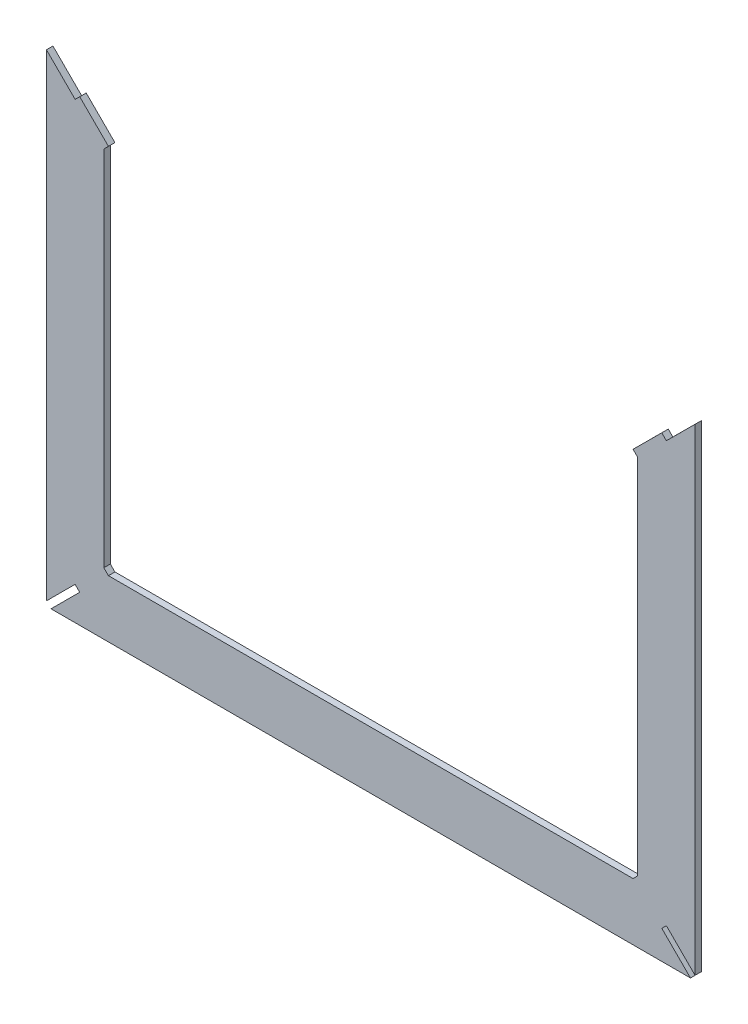
ISO-10303-21;
HEADER;
FILE_DESCRIPTION(('STEP AP214'),'2;1');
FILE_NAME('part.step','',(''),(''),'','','');
FILE_SCHEMA(('AUTOMOTIVE_DESIGN { 1 0 10303 214 1 1 1 1 }'));
ENDSEC;
DATA;
#1=APPLICATION_CONTEXT('core data for automotive mechanical design processes');
#2=APPLICATION_PROTOCOL_DEFINITION('international standard','automotive_design',2000,#1);
#3=PRODUCT_CONTEXT('',#1,'mechanical');
#4=PRODUCT('Part','Part','',(#3));
#5=PRODUCT_RELATED_PRODUCT_CATEGORY('part','',(#4));
#6=PRODUCT_DEFINITION_FORMATION('','',#4);
#7=PRODUCT_DEFINITION_CONTEXT('part definition',#1,'design');
#8=PRODUCT_DEFINITION('design','',#6,#7);
#9=PRODUCT_DEFINITION_SHAPE('','',#8);
#10=(LENGTH_UNIT() NAMED_UNIT(*) SI_UNIT(.MILLI.,.METRE.));
#11=(NAMED_UNIT(*) PLANE_ANGLE_UNIT() SI_UNIT($,.RADIAN.));
#12=(NAMED_UNIT(*) SI_UNIT($,.STERADIAN.) SOLID_ANGLE_UNIT());
#13=UNCERTAINTY_MEASURE_WITH_UNIT(LENGTH_MEASURE(1.E-05),#10,'distance_accuracy_value','');
#14=(GEOMETRIC_REPRESENTATION_CONTEXT(3) GLOBAL_UNCERTAINTY_ASSIGNED_CONTEXT((#13)) GLOBAL_UNIT_ASSIGNED_CONTEXT((#10,
#11,#12)) REPRESENTATION_CONTEXT('',''));
#15=CARTESIAN_POINT('',(0.,0.,0.));
#16=DIRECTION('',(0.,0.,1.));
#17=DIRECTION('',(1.,0.,0.));
#18=AXIS2_PLACEMENT_3D('',#15,#16,#17);
#19=CARTESIAN_POINT('',(-395.931011651863,-137.132902491065,4.));
#20=DIRECTION('',(0.,-1.,0.));
#21=DIRECTION('',(1.,0.,0.));
#22=AXIS2_PLACEMENT_3D('',#19,#20,#21);
#23=PLANE('',#22);
#24=DIRECTION('',(-1.,0.,0.));
#25=VECTOR('',#24,1.);
#26=CARTESIAN_POINT('',(-395.931011651863,-137.132902491065,0.));
#27=LINE('',#26,#25);
#28=CARTESIAN_POINT('',(-72.3878659013533,-137.132902491067,0.));
#29=VERTEX_POINT('',#28);
#30=CARTESIAN_POINT('',(-395.931011651863,-137.132902491065,0.));
#31=VERTEX_POINT('',#30);
#32=EDGE_CURVE('E213',#29,#31,#27,.T.);
#33=ORIENTED_EDGE('',*,*,#32,.T.);
#34=DIRECTION('',(0.,0.,-1.));
#35=VECTOR('',#34,1.);
#36=CARTESIAN_POINT('',(-395.931011651863,-137.132902491065,4.));
#37=LINE('',#36,#35);
#38=CARTESIAN_POINT('',(-395.931011651863,-137.132902491065,4.));
#39=VERTEX_POINT('',#38);
#40=EDGE_CURVE('E11',#39,#31,#37,.T.);
#41=ORIENTED_EDGE('',*,*,#40,.F.);
#42=DIRECTION('',(-1.,0.,0.));
#43=VECTOR('',#42,1.);
#44=CARTESIAN_POINT('',(-395.931011651863,-137.132902491065,4.));
#45=LINE('',#44,#43);
#46=CARTESIAN_POINT('',(-72.3878659013533,-137.132902491067,4.));
#47=VERTEX_POINT('',#46);
#48=EDGE_CURVE('E255',#47,#39,#45,.T.);
#49=ORIENTED_EDGE('',*,*,#48,.F.);
#50=DIRECTION('',(0.,0.,-1.));
#51=VECTOR('',#50,1.);
#52=CARTESIAN_POINT('',(-72.3878659013533,-137.132902491067,4.));
#53=LINE('',#52,#51);
#54=EDGE_CURVE('E209',#47,#29,#53,.T.);
#55=ORIENTED_EDGE('',*,*,#54,.T.);
#56=EDGE_LOOP('',(#33,#41,#49,#55));
#57=FACE_BOUND('',#56,.T.);
#58=ADVANCED_FACE('F33',(#57),#23,.F.);
#59=CARTESIAN_POINT('',(-398.759438776609,-134.304475366321,4.));
#60=DIRECTION('',(-0.707106781186277,-0.707106781186818,0.));
#61=DIRECTION('',(0.707106781186818,-0.707106781186277,0.));
#62=AXIS2_PLACEMENT_3D('',#59,#60,#61);
#63=PLANE('',#62);
#64=DIRECTION('',(-0.707106781186818,0.707106781186277,0.));
#65=VECTOR('',#64,1.);
#66=CARTESIAN_POINT('',(-398.759438776609,-134.304475366321,0.));
#67=LINE('',#66,#65);
#68=CARTESIAN_POINT('',(-398.759438776609,-134.304475366321,0.));
#69=VERTEX_POINT('',#68);
#70=EDGE_CURVE('E216',#31,#69,#67,.T.);
#71=ORIENTED_EDGE('',*,*,#70,.T.);
#72=DIRECTION('',(0.,0.,-1.));
#73=VECTOR('',#72,1.);
#74=CARTESIAN_POINT('',(-398.759438776609,-134.304475366321,4.));
#75=LINE('',#74,#73);
#76=CARTESIAN_POINT('',(-398.759438776609,-134.304475366321,4.));
#77=VERTEX_POINT('',#76);
#78=EDGE_CURVE('E41',#77,#69,#75,.T.);
#79=ORIENTED_EDGE('',*,*,#78,.F.);
#80=DIRECTION('',(-0.707106781186818,0.707106781186277,0.));
#81=VECTOR('',#80,1.);
#82=CARTESIAN_POINT('',(-398.759438776609,-134.304475366321,4.));
#83=LINE('',#82,#81);
#84=EDGE_CURVE('E134',#39,#77,#83,.T.);
#85=ORIENTED_EDGE('',*,*,#84,.F.);
#86=ORIENTED_EDGE('',*,*,#40,.T.);
#87=EDGE_LOOP('',(#71,#79,#85,#86));
#88=FACE_BOUND('',#87,.T.);
#89=ADVANCED_FACE('F383',(#88),#63,.F.);
#90=CARTESIAN_POINT('',(-398.759438776609,89.3280487527306,4.));
#91=DIRECTION('',(-1.,0.,0.));
#92=DIRECTION('',(0.,0.,1.));
#93=AXIS2_PLACEMENT_3D('',#90,#91,#92);
#94=PLANE('',#93);
#95=DIRECTION('',(0.,1.,0.));
#96=VECTOR('',#95,1.);
#97=CARTESIAN_POINT('',(-398.759438776609,89.3280487527306,0.));
#98=LINE('',#97,#96);
#99=CARTESIAN_POINT('',(-398.759438776609,89.3280487527306,0.));
#100=VERTEX_POINT('',#99);
#101=EDGE_CURVE('E218',#69,#100,#98,.T.);
#102=ORIENTED_EDGE('',*,*,#101,.T.);
#103=DIRECTION('',(0.,0.,-1.));
#104=VECTOR('',#103,1.);
#105=CARTESIAN_POINT('',(-398.759438776609,89.3280487527306,4.));
#106=LINE('',#105,#104);
#107=CARTESIAN_POINT('',(-398.759438776609,89.3280487527306,4.));
#108=VERTEX_POINT('',#107);
#109=EDGE_CURVE('E304',#108,#100,#106,.T.);
#110=ORIENTED_EDGE('',*,*,#109,.F.);
#111=DIRECTION('',(0.,1.,0.));
#112=VECTOR('',#111,1.);
#113=CARTESIAN_POINT('',(-398.759438776609,89.3280487527306,4.));
#114=LINE('',#113,#112);
#115=EDGE_CURVE('E312',#77,#108,#114,.T.);
#116=ORIENTED_EDGE('',*,*,#115,.F.);
#117=ORIENTED_EDGE('',*,*,#78,.T.);
#118=EDGE_LOOP('',(#102,#110,#116,#117));
#119=FACE_BOUND('',#118,.T.);
#120=ADVANCED_FACE('F310',(#119),#94,.F.);
#121=CARTESIAN_POINT('',(-395.934589046093,92.1600487527305,4.));
#122=DIRECTION('',(-0.707999999999985,0.706212432629178,0.));
#123=DIRECTION('',(-0.706212432629178,-0.707999999999985,0.));
#124=AXIS2_PLACEMENT_3D('',#121,#122,#123);
#125=PLANE('',#124);
#126=DIRECTION('',(0.706212432629178,0.707999999999985,0.));
#127=VECTOR('',#126,1.);
#128=CARTESIAN_POINT('',(-395.934589046093,92.1600487527305,0.));
#129=LINE('',#128,#127);
#130=CARTESIAN_POINT('',(-395.934589046093,92.1600487527305,0.));
#131=VERTEX_POINT('',#130);
#132=EDGE_CURVE('E220',#100,#131,#129,.T.);
#133=ORIENTED_EDGE('',*,*,#132,.T.);
#134=DIRECTION('',(0.,0.,-1.));
#135=VECTOR('',#134,1.);
#136=CARTESIAN_POINT('',(-395.934589046093,92.1600487527305,4.));
#137=LINE('',#136,#135);
#138=CARTESIAN_POINT('',(-395.934589046093,92.1600487527305,4.));
#139=VERTEX_POINT('',#138);
#140=EDGE_CURVE('E301',#139,#131,#137,.T.);
#141=ORIENTED_EDGE('',*,*,#140,.F.);
#142=DIRECTION('',(0.706212432629178,0.707999999999985,0.));
#143=VECTOR('',#142,1.);
#144=CARTESIAN_POINT('',(-395.934589046093,92.1600487527305,4.));
#145=LINE('',#144,#143);
#146=EDGE_CURVE('E330',#108,#139,#145,.T.);
#147=ORIENTED_EDGE('',*,*,#146,.F.);
#148=ORIENTED_EDGE('',*,*,#109,.T.);
#149=EDGE_LOOP('',(#133,#141,#147,#148));
#150=FACE_BOUND('',#149,.T.);
#151=ADVANCED_FACE('F321',(#150),#125,.F.);
#152=CARTESIAN_POINT('',(-395.934589046093,92.1600487527305,4.));
#153=DIRECTION('',(-0.706212432629162,-0.708000000000001,0.));
#154=DIRECTION('',(0.708000000000001,-0.706212432629162,0.));
#155=AXIS2_PLACEMENT_3D('',#152,#153,#154);
#156=PLANE('',#155);
#157=DIRECTION('',(-0.708000000000001,0.706212432629162,0.));
#158=VECTOR('',#157,1.);
#159=CARTESIAN_POINT('',(-395.934589046093,92.1600487527305,0.));
#160=LINE('',#159,#158);
#161=CARTESIAN_POINT('',(-413.634589046093,109.81535956846,0.));
#162=VERTEX_POINT('',#161);
#163=EDGE_CURVE('E222',#131,#162,#160,.T.);
#164=ORIENTED_EDGE('',*,*,#163,.T.);
#165=DIRECTION('',(0.,0.,-1.));
#166=VECTOR('',#165,1.);
#167=CARTESIAN_POINT('',(-413.634589046093,109.81535956846,4.));
#168=LINE('',#167,#166);
#169=CARTESIAN_POINT('',(-413.634589046093,109.81535956846,4.));
#170=VERTEX_POINT('',#169);
#171=EDGE_CURVE('E298',#170,#162,#168,.T.);
#172=ORIENTED_EDGE('',*,*,#171,.F.);
#173=DIRECTION('',(-0.708000000000001,0.706212432629162,0.));
#174=VECTOR('',#173,1.);
#175=CARTESIAN_POINT('',(-395.934589046093,92.1600487527305,4.));
#176=LINE('',#175,#174);
#177=EDGE_CURVE('E327',#139,#170,#176,.T.);
#178=ORIENTED_EDGE('',*,*,#177,.F.);
#179=ORIENTED_EDGE('',*,*,#140,.T.);
#180=EDGE_LOOP('',(#164,#172,#178,#179));
#181=FACE_BOUND('',#180,.T.);
#182=ADVANCED_FACE('F325',(#181),#156,.F.);
#183=CARTESIAN_POINT('',(-413.634589046093,109.81535956846,4.));
#184=DIRECTION('',(0.708,-0.706212432629163,0.));
#185=DIRECTION('',(0.706212432629163,0.708,0.));
#186=AXIS2_PLACEMENT_3D('',#183,#184,#185);
#187=PLANE('',#186);
#188=DIRECTION('',(-0.706212432629163,-0.708,0.));
#189=VECTOR('',#188,1.);
#190=CARTESIAN_POINT('',(-413.634589046093,109.81535956846,0.));
#191=LINE('',#190,#189);
#192=CARTESIAN_POINT('',(-416.459438776609,106.98335956846,0.));
#193=VERTEX_POINT('',#192);
#194=EDGE_CURVE('E224',#162,#193,#191,.T.);
#195=ORIENTED_EDGE('',*,*,#194,.T.);
#196=DIRECTION('',(0.,0.,-1.));
#197=VECTOR('',#196,1.);
#198=CARTESIAN_POINT('',(-416.459438776609,106.98335956846,4.));
#199=LINE('',#198,#197);
#200=CARTESIAN_POINT('',(-416.459438776609,106.98335956846,4.));
#201=VERTEX_POINT('',#200);
#202=EDGE_CURVE('E295',#201,#193,#199,.T.);
#203=ORIENTED_EDGE('',*,*,#202,.F.);
#204=DIRECTION('',(-0.706212432629163,-0.708,0.));
#205=VECTOR('',#204,1.);
#206=CARTESIAN_POINT('',(-413.634589046093,109.81535956846,4.));
#207=LINE('',#206,#205);
#208=EDGE_CURVE('E329',#170,#201,#207,.T.);
#209=ORIENTED_EDGE('',*,*,#208,.F.);
#210=ORIENTED_EDGE('',*,*,#171,.T.);
#211=EDGE_LOOP('',(#195,#203,#209,#210));
#212=FACE_BOUND('',#211,.T.);
#213=ADVANCED_FACE('F396',(#212),#187,.F.);
#214=CARTESIAN_POINT('',(-416.459438776609,106.98335956846,4.));
#215=DIRECTION('',(-0.706212432629163,-0.708,0.));
#216=DIRECTION('',(0.708,-0.706212432629163,0.));
#217=AXIS2_PLACEMENT_3D('',#214,#215,#216);
#218=PLANE('',#217);
#219=DIRECTION('',(-0.708,0.706212432629163,0.));
#220=VECTOR('',#219,1.);
#221=CARTESIAN_POINT('',(-416.459438776609,106.98335956846,0.));
#222=LINE('',#221,#220);
#223=CARTESIAN_POINT('',(-434.159438776609,124.638670384189,0.));
#224=VERTEX_POINT('',#223);
#225=EDGE_CURVE('E226',#193,#224,#222,.T.);
#226=ORIENTED_EDGE('',*,*,#225,.T.);
#227=DIRECTION('',(0.,0.,-1.));
#228=VECTOR('',#227,1.);
#229=CARTESIAN_POINT('',(-434.159438776609,124.638670384189,4.));
#230=LINE('',#229,#228);
#231=CARTESIAN_POINT('',(-434.159438776609,124.638670384189,4.));
#232=VERTEX_POINT('',#231);
#233=EDGE_CURVE('E292',#232,#224,#230,.T.);
#234=ORIENTED_EDGE('',*,*,#233,.F.);
#235=DIRECTION('',(-0.708,0.706212432629163,0.));
#236=VECTOR('',#235,1.);
#237=CARTESIAN_POINT('',(-416.459438776609,106.98335956846,4.));
#238=LINE('',#237,#236);
#239=EDGE_CURVE('E332',#201,#232,#238,.T.);
#240=ORIENTED_EDGE('',*,*,#239,.F.);
#241=ORIENTED_EDGE('',*,*,#202,.T.);
#242=EDGE_LOOP('',(#226,#234,#240,#241));
#243=FACE_BOUND('',#242,.T.);
#244=ADVANCED_FACE('F399',(#243),#218,.F.);
#245=CARTESIAN_POINT('',(-434.159438776609,124.638670384189,4.));
#246=DIRECTION('',(1.,0.,0.));
#247=DIRECTION('',(0.,1.,0.));
#248=AXIS2_PLACEMENT_3D('',#245,#246,#247);
#249=PLANE('',#248);
#250=DIRECTION('',(0.,-1.,0.));
#251=VECTOR('',#250,1.);
#252=CARTESIAN_POINT('',(-434.159438776609,124.638670384189,0.));
#253=LINE('',#252,#251);
#254=CARTESIAN_POINT('',(-434.15943877661,-169.704475366319,0.));
#255=VERTEX_POINT('',#254);
#256=EDGE_CURVE('E228',#224,#255,#253,.T.);
#257=ORIENTED_EDGE('',*,*,#256,.T.);
#258=DIRECTION('',(0.,0.,-1.));
#259=VECTOR('',#258,1.);
#260=CARTESIAN_POINT('',(-434.15943877661,-169.704475366319,4.));
#261=LINE('',#260,#259);
#262=CARTESIAN_POINT('',(-434.15943877661,-169.704475366319,4.));
#263=VERTEX_POINT('',#262);
#264=EDGE_CURVE('E289',#263,#255,#261,.T.);
#265=ORIENTED_EDGE('',*,*,#264,.F.);
#266=DIRECTION('',(0.,-1.,0.));
#267=VECTOR('',#266,1.);
#268=CARTESIAN_POINT('',(-434.159438776609,124.638670384189,4.));
#269=LINE('',#268,#267);
#270=EDGE_CURVE('E338',#232,#263,#269,.T.);
#271=ORIENTED_EDGE('',*,*,#270,.F.);
#272=ORIENTED_EDGE('',*,*,#233,.T.);
#273=EDGE_LOOP('',(#257,#265,#271,#272));
#274=FACE_BOUND('',#273,.T.);
#275=ADVANCED_FACE('F403',(#274),#249,.F.);
#276=CARTESIAN_POINT('',(-416.481769246946,-152.026805836655,4.));
#277=DIRECTION('',(-0.707106781186547,0.707106781186547,0.));
#278=DIRECTION('',(-0.707106781186548,-0.707106781186548,0.));
#279=AXIS2_PLACEMENT_3D('',#276,#277,#278);
#280=PLANE('',#279);
#281=DIRECTION('',(0.707106781186547,0.707106781186547,0.));
#282=VECTOR('',#281,1.);
#283=CARTESIAN_POINT('',(-416.481769246946,-152.026805836655,0.));
#284=LINE('',#283,#282);
#285=CARTESIAN_POINT('',(-416.481769246946,-152.026805836655,0.));
#286=VERTEX_POINT('',#285);
#287=EDGE_CURVE('E230',#255,#286,#284,.T.);
#288=ORIENTED_EDGE('',*,*,#287,.T.);
#289=DIRECTION('',(0.,0.,-1.));
#290=VECTOR('',#289,1.);
#291=CARTESIAN_POINT('',(-416.481769246946,-152.026805836655,4.));
#292=LINE('',#291,#290);
#293=CARTESIAN_POINT('',(-416.481769246946,-152.026805836655,4.));
#294=VERTEX_POINT('',#293);
#295=EDGE_CURVE('E286',#294,#286,#292,.T.);
#296=ORIENTED_EDGE('',*,*,#295,.F.);
#297=DIRECTION('',(0.707106781186547,0.707106781186547,0.));
#298=VECTOR('',#297,1.);
#299=CARTESIAN_POINT('',(-416.481769246946,-152.026805836655,4.));
#300=LINE('',#299,#298);
#301=EDGE_CURVE('E340',#263,#294,#300,.T.);
#302=ORIENTED_EDGE('',*,*,#301,.F.);
#303=ORIENTED_EDGE('',*,*,#264,.T.);
#304=EDGE_LOOP('',(#288,#296,#302,#303));
#305=FACE_BOUND('',#304,.T.);
#306=ADVANCED_FACE('F407',(#305),#280,.F.);
#307=CARTESIAN_POINT('',(-413.6533421222,-154.855232961401,4.));
#308=DIRECTION('',(0.707106781186558,0.707106781186537,0.));
#309=DIRECTION('',(-0.707106781186537,0.707106781186558,0.));
#310=AXIS2_PLACEMENT_3D('',#307,#308,#309);
#311=PLANE('',#310);
#312=DIRECTION('',(0.707106781186537,-0.707106781186558,0.));
#313=VECTOR('',#312,1.);
#314=CARTESIAN_POINT('',(-413.6533421222,-154.855232961401,0.));
#315=LINE('',#314,#313);
#316=CARTESIAN_POINT('',(-413.6533421222,-154.855232961401,0.));
#317=VERTEX_POINT('',#316);
#318=EDGE_CURVE('E232',#286,#317,#315,.T.);
#319=ORIENTED_EDGE('',*,*,#318,.T.);
#320=DIRECTION('',(0.,0.,-1.));
#321=VECTOR('',#320,1.);
#322=CARTESIAN_POINT('',(-413.6533421222,-154.855232961401,4.));
#323=LINE('',#322,#321);
#324=CARTESIAN_POINT('',(-413.6533421222,-154.855232961401,4.));
#325=VERTEX_POINT('',#324);
#326=EDGE_CURVE('E283',#325,#317,#323,.T.);
#327=ORIENTED_EDGE('',*,*,#326,.F.);
#328=DIRECTION('',(0.707106781186537,-0.707106781186558,0.));
#329=VECTOR('',#328,1.);
#330=CARTESIAN_POINT('',(-413.6533421222,-154.855232961401,4.));
#331=LINE('',#330,#329);
#332=EDGE_CURVE('E342',#294,#325,#331,.T.);
#333=ORIENTED_EDGE('',*,*,#332,.F.);
#334=ORIENTED_EDGE('',*,*,#295,.T.);
#335=EDGE_LOOP('',(#319,#327,#333,#334));
#336=FACE_BOUND('',#335,.T.);
#337=ADVANCED_FACE('F411',(#336),#311,.F.);
#338=CARTESIAN_POINT('',(-431.331011651864,-172.532902491065,4.));
#339=DIRECTION('',(0.707106781186549,-0.707106781186546,0.));
#340=DIRECTION('',(0.707106781186546,0.707106781186549,0.));
#341=AXIS2_PLACEMENT_3D('',#338,#339,#340);
#342=PLANE('',#341);
#343=DIRECTION('',(-0.707106781186546,-0.707106781186549,0.));
#344=VECTOR('',#343,1.);
#345=CARTESIAN_POINT('',(-431.331011651864,-172.532902491065,0.));
#346=LINE('',#345,#344);
#347=CARTESIAN_POINT('',(-431.331011651864,-172.532902491065,0.));
#348=VERTEX_POINT('',#347);
#349=EDGE_CURVE('E234',#317,#348,#346,.T.);
#350=ORIENTED_EDGE('',*,*,#349,.T.);
#351=DIRECTION('',(0.,0.,-1.));
#352=VECTOR('',#351,1.);
#353=CARTESIAN_POINT('',(-431.331011651864,-172.532902491065,4.));
#354=LINE('',#353,#352);
#355=CARTESIAN_POINT('',(-431.331011651864,-172.532902491065,4.));
#356=VERTEX_POINT('',#355);
#357=EDGE_CURVE('E280',#356,#348,#354,.T.);
#358=ORIENTED_EDGE('',*,*,#357,.F.);
#359=DIRECTION('',(-0.707106781186546,-0.707106781186549,0.));
#360=VECTOR('',#359,1.);
#361=CARTESIAN_POINT('',(-431.331011651864,-172.532902491065,4.));
#362=LINE('',#361,#360);
#363=EDGE_CURVE('E344',#325,#356,#362,.T.);
#364=ORIENTED_EDGE('',*,*,#363,.F.);
#365=ORIENTED_EDGE('',*,*,#326,.T.);
#366=EDGE_LOOP('',(#350,#358,#364,#365));
#367=FACE_BOUND('',#366,.T.);
#368=ADVANCED_FACE('F415',(#367),#342,.F.);
#369=CARTESIAN_POINT('',(-431.331011651864,-172.532902491065,4.));
#370=DIRECTION('',(0.,1.,0.));
#371=DIRECTION('',(-1.,0.,0.));
#372=AXIS2_PLACEMENT_3D('',#369,#370,#371);
#373=PLANE('',#372);
#374=DIRECTION('',(1.,0.,0.));
#375=VECTOR('',#374,1.);
#376=CARTESIAN_POINT('',(-431.331011651864,-172.532902491065,0.));
#377=LINE('',#376,#375);
#378=CARTESIAN_POINT('',(-36.9878659013554,-172.532902491066,0.));
#379=VERTEX_POINT('',#378);
#380=EDGE_CURVE('E236',#348,#379,#377,.T.);
#381=ORIENTED_EDGE('',*,*,#380,.T.);
#382=DIRECTION('',(0.,0.,-1.));
#383=VECTOR('',#382,1.);
#384=CARTESIAN_POINT('',(-36.9878659013554,-172.532902491066,4.));
#385=LINE('',#384,#383);
#386=CARTESIAN_POINT('',(-36.9878659013554,-172.532902491066,4.));
#387=VERTEX_POINT('',#386);
#388=EDGE_CURVE('E277',#387,#379,#385,.T.);
#389=ORIENTED_EDGE('',*,*,#388,.F.);
#390=DIRECTION('',(1.,0.,0.));
#391=VECTOR('',#390,1.);
#392=CARTESIAN_POINT('',(-431.331011651864,-172.532902491065,4.));
#393=LINE('',#392,#391);
#394=EDGE_CURVE('E346',#356,#387,#393,.T.);
#395=ORIENTED_EDGE('',*,*,#394,.F.);
#396=ORIENTED_EDGE('',*,*,#357,.T.);
#397=EDGE_LOOP('',(#381,#389,#395,#396));
#398=FACE_BOUND('',#397,.T.);
#399=ADVANCED_FACE('F419',(#398),#373,.F.);
#400=CARTESIAN_POINT('',(-54.6655354310192,-154.855232961402,4.));
#401=DIRECTION('',(-0.707106781186559,-0.707106781186536,0.));
#402=DIRECTION('',(0.707106781186536,-0.707106781186559,0.));
#403=AXIS2_PLACEMENT_3D('',#400,#401,#402);
#404=PLANE('',#403);
#405=DIRECTION('',(-0.707106781186536,0.707106781186559,0.));
#406=VECTOR('',#405,1.);
#407=CARTESIAN_POINT('',(-54.6655354310192,-154.855232961402,0.));
#408=LINE('',#407,#406);
#409=CARTESIAN_POINT('',(-54.6655354310192,-154.855232961402,0.));
#410=VERTEX_POINT('',#409);
#411=EDGE_CURVE('E238',#379,#410,#408,.T.);
#412=ORIENTED_EDGE('',*,*,#411,.T.);
#413=DIRECTION('',(0.,0.,-1.));
#414=VECTOR('',#413,1.);
#415=CARTESIAN_POINT('',(-54.6655354310192,-154.855232961402,4.));
#416=LINE('',#415,#414);
#417=CARTESIAN_POINT('',(-54.6655354310192,-154.855232961402,4.));
#418=VERTEX_POINT('',#417);
#419=EDGE_CURVE('E274',#418,#410,#416,.T.);
#420=ORIENTED_EDGE('',*,*,#419,.F.);
#421=DIRECTION('',(-0.707106781186536,0.707106781186559,0.));
#422=VECTOR('',#421,1.);
#423=CARTESIAN_POINT('',(-54.6655354310192,-154.855232961402,4.));
#424=LINE('',#423,#422);
#425=EDGE_CURVE('E348',#387,#418,#424,.T.);
#426=ORIENTED_EDGE('',*,*,#425,.F.);
#427=ORIENTED_EDGE('',*,*,#388,.T.);
#428=EDGE_LOOP('',(#412,#420,#426,#427));
#429=FACE_BOUND('',#428,.T.);
#430=ADVANCED_FACE('F423',(#429),#404,.F.);
#431=CARTESIAN_POINT('',(-51.837108306273,-152.026805836655,4.));
#432=DIRECTION('',(-0.70710678118655,0.707106781186545,0.));
#433=DIRECTION('',(-0.707106781186545,-0.70710678118655,0.));
#434=AXIS2_PLACEMENT_3D('',#431,#432,#433);
#435=PLANE('',#434);
#436=DIRECTION('',(0.707106781186545,0.70710678118655,0.));
#437=VECTOR('',#436,1.);
#438=CARTESIAN_POINT('',(-51.837108306273,-152.026805836655,0.));
#439=LINE('',#438,#437);
#440=CARTESIAN_POINT('',(-51.837108306273,-152.026805836655,0.));
#441=VERTEX_POINT('',#440);
#442=EDGE_CURVE('E240',#410,#441,#439,.T.);
#443=ORIENTED_EDGE('',*,*,#442,.T.);
#444=DIRECTION('',(0.,0.,-1.));
#445=VECTOR('',#444,1.);
#446=CARTESIAN_POINT('',(-51.837108306273,-152.026805836655,4.));
#447=LINE('',#446,#445);
#448=CARTESIAN_POINT('',(-51.837108306273,-152.026805836655,4.));
#449=VERTEX_POINT('',#448);
#450=EDGE_CURVE('E271',#449,#441,#447,.T.);
#451=ORIENTED_EDGE('',*,*,#450,.F.);
#452=DIRECTION('',(0.707106781186545,0.70710678118655,0.));
#453=VECTOR('',#452,1.);
#454=CARTESIAN_POINT('',(-51.837108306273,-152.026805836655,4.));
#455=LINE('',#454,#453);
#456=EDGE_CURVE('E350',#418,#449,#455,.T.);
#457=ORIENTED_EDGE('',*,*,#456,.F.);
#458=ORIENTED_EDGE('',*,*,#419,.T.);
#459=EDGE_LOOP('',(#443,#451,#457,#458));
#460=FACE_BOUND('',#459,.T.);
#461=ADVANCED_FACE('F427',(#460),#435,.F.);
#462=CARTESIAN_POINT('',(-34.1594387766093,-169.704475366319,4.));
#463=DIRECTION('',(0.707106781186546,0.707106781186549,0.));
#464=DIRECTION('',(-0.707106781186549,0.707106781186546,0.));
#465=AXIS2_PLACEMENT_3D('',#462,#463,#464);
#466=PLANE('',#465);
#467=DIRECTION('',(0.707106781186549,-0.707106781186546,0.));
#468=VECTOR('',#467,1.);
#469=CARTESIAN_POINT('',(-34.1594387766093,-169.704475366319,0.));
#470=LINE('',#469,#468);
#471=CARTESIAN_POINT('',(-34.1594387766093,-169.704475366319,0.));
#472=VERTEX_POINT('',#471);
#473=EDGE_CURVE('E242',#441,#472,#470,.T.);
#474=ORIENTED_EDGE('',*,*,#473,.T.);
#475=DIRECTION('',(0.,0.,-1.));
#476=VECTOR('',#475,1.);
#477=CARTESIAN_POINT('',(-34.1594387766093,-169.704475366319,4.));
#478=LINE('',#477,#476);
#479=CARTESIAN_POINT('',(-34.1594387766093,-169.704475366319,4.));
#480=VERTEX_POINT('',#479);
#481=EDGE_CURVE('E268',#480,#472,#478,.T.);
#482=ORIENTED_EDGE('',*,*,#481,.F.);
#483=DIRECTION('',(0.707106781186549,-0.707106781186546,0.));
#484=VECTOR('',#483,1.);
#485=CARTESIAN_POINT('',(-34.1594387766093,-169.704475366319,4.));
#486=LINE('',#485,#484);
#487=EDGE_CURVE('E352',#449,#480,#486,.T.);
#488=ORIENTED_EDGE('',*,*,#487,.F.);
#489=ORIENTED_EDGE('',*,*,#450,.T.);
#490=EDGE_LOOP('',(#474,#482,#488,#489));
#491=FACE_BOUND('',#490,.T.);
#492=ADVANCED_FACE('F431',(#491),#466,.F.);
#493=CARTESIAN_POINT('',(-34.1594387766093,-169.704475366319,4.));
#494=DIRECTION('',(-1.,0.,0.));
#495=DIRECTION('',(0.,-1.,0.));
#496=AXIS2_PLACEMENT_3D('',#493,#494,#495);
#497=PLANE('',#496);
#498=DIRECTION('',(0.,1.,0.));
#499=VECTOR('',#498,1.);
#500=CARTESIAN_POINT('',(-34.1594387766093,-169.704475366319,0.));
#501=LINE('',#500,#499);
#502=CARTESIAN_POINT('',(-34.1594387766093,124.626367891697,0.));
#503=VERTEX_POINT('',#502);
#504=EDGE_CURVE('E244',#472,#503,#501,.T.);
#505=ORIENTED_EDGE('',*,*,#504,.T.);
#506=DIRECTION('',(0.,0.,-1.));
#507=VECTOR('',#506,1.);
#508=CARTESIAN_POINT('',(-34.1594387766093,124.626367891697,4.));
#509=LINE('',#508,#507);
#510=CARTESIAN_POINT('',(-34.1594387766093,124.626367891697,4.));
#511=VERTEX_POINT('',#510);
#512=EDGE_CURVE('E265',#511,#503,#509,.T.);
#513=ORIENTED_EDGE('',*,*,#512,.F.);
#514=DIRECTION('',(0.,1.,0.));
#515=VECTOR('',#514,1.);
#516=CARTESIAN_POINT('',(-34.1594387766093,-169.704475366319,4.));
#517=LINE('',#516,#515);
#518=EDGE_CURVE('E354',#480,#511,#517,.T.);
#519=ORIENTED_EDGE('',*,*,#518,.F.);
#520=ORIENTED_EDGE('',*,*,#481,.T.);
#521=EDGE_LOOP('',(#505,#513,#519,#520));
#522=FACE_BOUND('',#521,.T.);
#523=ADVANCED_FACE('F435',(#522),#497,.F.);
#524=CARTESIAN_POINT('',(-34.1594387766093,124.626367891697,4.));
#525=DIRECTION('',(0.706212432629174,-0.707999999999989,0.));
#526=DIRECTION('',(0.707999999999989,0.706212432629174,0.));
#527=AXIS2_PLACEMENT_3D('',#524,#525,#526);
#528=PLANE('',#527);
#529=DIRECTION('',(-0.707999999999989,-0.706212432629174,0.));
#530=VECTOR('',#529,1.);
#531=CARTESIAN_POINT('',(-34.1594387766093,124.626367891697,0.));
#532=LINE('',#531,#530);
#533=CARTESIAN_POINT('',(-51.859438776609,106.971057075968,0.));
#534=VERTEX_POINT('',#533);
#535=EDGE_CURVE('E246',#503,#534,#532,.T.);
#536=ORIENTED_EDGE('',*,*,#535,.T.);
#537=DIRECTION('',(0.,0.,-1.));
#538=VECTOR('',#537,1.);
#539=CARTESIAN_POINT('',(-51.859438776609,106.971057075968,4.));
#540=LINE('',#539,#538);
#541=CARTESIAN_POINT('',(-51.859438776609,106.971057075968,4.));
#542=VERTEX_POINT('',#541);
#543=EDGE_CURVE('E262',#542,#534,#540,.T.);
#544=ORIENTED_EDGE('',*,*,#543,.F.);
#545=DIRECTION('',(-0.707999999999989,-0.706212432629174,0.));
#546=VECTOR('',#545,1.);
#547=CARTESIAN_POINT('',(-34.1594387766093,124.626367891697,4.));
#548=LINE('',#547,#546);
#549=EDGE_CURVE('E356',#511,#542,#548,.T.);
#550=ORIENTED_EDGE('',*,*,#549,.F.);
#551=ORIENTED_EDGE('',*,*,#512,.T.);
#552=EDGE_LOOP('',(#536,#544,#550,#551));
#553=FACE_BOUND('',#552,.T.);
#554=ADVANCED_FACE('F439',(#553),#528,.F.);
#555=CARTESIAN_POINT('',(-51.859438776609,106.971057075968,4.));
#556=DIRECTION('',(-0.70799999999999,-0.706212432629173,0.));
#557=DIRECTION('',(0.706212432629173,-0.70799999999999,0.));
#558=AXIS2_PLACEMENT_3D('',#555,#556,#557);
#559=PLANE('',#558);
#560=DIRECTION('',(-0.706212432629173,0.70799999999999,0.));
#561=VECTOR('',#560,1.);
#562=CARTESIAN_POINT('',(-51.859438776609,106.971057075968,0.));
#563=LINE('',#562,#561);
#564=CARTESIAN_POINT('',(-54.6842885071257,109.803057075968,0.));
#565=VERTEX_POINT('',#564);
#566=EDGE_CURVE('E248',#534,#565,#563,.T.);
#567=ORIENTED_EDGE('',*,*,#566,.T.);
#568=DIRECTION('',(0.,0.,-1.));
#569=VECTOR('',#568,1.);
#570=CARTESIAN_POINT('',(-54.6842885071257,109.803057075968,4.));
#571=LINE('',#570,#569);
#572=CARTESIAN_POINT('',(-54.6842885071257,109.803057075968,4.));
#573=VERTEX_POINT('',#572);
#574=EDGE_CURVE('E259',#573,#565,#571,.T.);
#575=ORIENTED_EDGE('',*,*,#574,.F.);
#576=DIRECTION('',(-0.706212432629173,0.70799999999999,0.));
#577=VECTOR('',#576,1.);
#578=CARTESIAN_POINT('',(-51.859438776609,106.971057075968,4.));
#579=LINE('',#578,#577);
#580=EDGE_CURVE('E358',#542,#573,#579,.T.);
#581=ORIENTED_EDGE('',*,*,#580,.F.);
#582=ORIENTED_EDGE('',*,*,#543,.T.);
#583=EDGE_LOOP('',(#567,#575,#581,#582));
#584=FACE_BOUND('',#583,.T.);
#585=ADVANCED_FACE('F364',(#584),#559,.F.);
#586=CARTESIAN_POINT('',(-54.6842885071257,109.803057075968,4.));
#587=DIRECTION('',(0.706212432629174,-0.707999999999989,0.));
#588=DIRECTION('',(0.707999999999989,0.706212432629174,0.));
#589=AXIS2_PLACEMENT_3D('',#586,#587,#588);
#590=PLANE('',#589);
#591=DIRECTION('',(-0.707999999999989,-0.706212432629174,0.));
#592=VECTOR('',#591,1.);
#593=CARTESIAN_POINT('',(-54.6842885071257,109.803057075968,0.));
#594=LINE('',#593,#592);
#595=CARTESIAN_POINT('',(-72.3842885071254,92.1477462602384,0.));
#596=VERTEX_POINT('',#595);
#597=EDGE_CURVE('E250',#565,#596,#594,.T.);
#598=ORIENTED_EDGE('',*,*,#597,.T.);
#599=DIRECTION('',(0.,0.,-1.));
#600=VECTOR('',#599,1.);
#601=CARTESIAN_POINT('',(-72.3842885071254,92.1477462602384,4.));
#602=LINE('',#601,#600);
#603=CARTESIAN_POINT('',(-72.3842885071254,92.1477462602384,4.));
#604=VERTEX_POINT('',#603);
#605=EDGE_CURVE('E204',#604,#596,#602,.T.);
#606=ORIENTED_EDGE('',*,*,#605,.F.);
#607=DIRECTION('',(-0.707999999999989,-0.706212432629174,0.));
#608=VECTOR('',#607,1.);
#609=CARTESIAN_POINT('',(-54.6842885071257,109.803057075968,4.));
#610=LINE('',#609,#608);
#611=EDGE_CURVE('E195',#573,#604,#610,.T.);
#612=ORIENTED_EDGE('',*,*,#611,.F.);
#613=ORIENTED_EDGE('',*,*,#574,.T.);
#614=EDGE_LOOP('',(#598,#606,#612,#613));
#615=FACE_BOUND('',#614,.T.);
#616=ADVANCED_FACE('F368',(#615),#590,.F.);
#617=CARTESIAN_POINT('',(-72.3842885071254,92.1477462602384,4.));
#618=DIRECTION('',(0.70799999999999,0.706212432629173,0.));
#619=DIRECTION('',(-0.706212432629173,0.70799999999999,0.));
#620=AXIS2_PLACEMENT_3D('',#617,#618,#619);
#621=PLANE('',#620);
#622=DIRECTION('',(0.706212432629173,-0.70799999999999,0.));
#623=VECTOR('',#622,1.);
#624=CARTESIAN_POINT('',(-72.3842885071254,92.1477462602384,0.));
#625=LINE('',#624,#623);
#626=CARTESIAN_POINT('',(-69.5594387766088,89.3157462602384,0.));
#627=VERTEX_POINT('',#626);
#628=EDGE_CURVE('E203',#596,#627,#625,.T.);
#629=ORIENTED_EDGE('',*,*,#628,.T.);
#630=DIRECTION('',(0.,0.,-1.));
#631=VECTOR('',#630,1.);
#632=CARTESIAN_POINT('',(-69.5594387766088,89.3157462602384,4.));
#633=LINE('',#632,#631);
#634=CARTESIAN_POINT('',(-69.5594387766088,89.3157462602384,4.));
#635=VERTEX_POINT('',#634);
#636=EDGE_CURVE('E200',#635,#627,#633,.T.);
#637=ORIENTED_EDGE('',*,*,#636,.F.);
#638=DIRECTION('',(0.706212432629173,-0.70799999999999,0.));
#639=VECTOR('',#638,1.);
#640=CARTESIAN_POINT('',(-72.3842885071254,92.1477462602384,4.));
#641=LINE('',#640,#639);
#642=EDGE_CURVE('E189',#604,#635,#641,.T.);
#643=ORIENTED_EDGE('',*,*,#642,.F.);
#644=ORIENTED_EDGE('',*,*,#605,.T.);
#645=EDGE_LOOP('',(#629,#637,#643,#644));
#646=FACE_BOUND('',#645,.T.);
#647=ADVANCED_FACE('F201',(#646),#621,.F.);
#648=CARTESIAN_POINT('',(-69.5594387766088,89.3157462602384,4.));
#649=DIRECTION('',(1.,0.,0.));
#650=DIRECTION('',(0.,1.,0.));
#651=AXIS2_PLACEMENT_3D('',#648,#649,#650);
#652=PLANE('',#651);
#653=DIRECTION('',(0.,-1.,0.));
#654=VECTOR('',#653,1.);
#655=CARTESIAN_POINT('',(-69.5594387766088,89.3157462602384,0.));
#656=LINE('',#655,#654);
#657=CARTESIAN_POINT('',(-69.5594387766088,-134.304475366319,0.));
#658=VERTEX_POINT('',#657);
#659=EDGE_CURVE('E120',#627,#658,#656,.T.);
#660=ORIENTED_EDGE('',*,*,#659,.T.);
#661=DIRECTION('',(0.,0.,-1.));
#662=VECTOR('',#661,1.);
#663=CARTESIAN_POINT('',(-69.5594387766088,-134.304475366319,4.));
#664=LINE('',#663,#662);
#665=CARTESIAN_POINT('',(-69.5594387766088,-134.304475366319,4.));
#666=VERTEX_POINT('',#665);
#667=EDGE_CURVE('E205',#666,#658,#664,.T.);
#668=ORIENTED_EDGE('',*,*,#667,.F.);
#669=DIRECTION('',(0.,-1.,0.));
#670=VECTOR('',#669,1.);
#671=CARTESIAN_POINT('',(-69.5594387766088,89.3157462602384,4.));
#672=LINE('',#671,#670);
#673=EDGE_CURVE('E193',#635,#666,#672,.T.);
#674=ORIENTED_EDGE('',*,*,#673,.F.);
#675=ORIENTED_EDGE('',*,*,#636,.T.);
#676=EDGE_LOOP('',(#660,#668,#674,#675));
#677=FACE_BOUND('',#676,.T.);
#678=ADVANCED_FACE('F207',(#677),#652,.F.);
#679=CARTESIAN_POINT('',(-72.3878659013533,-137.132902491067,4.));
#680=DIRECTION('',(0.707106781186967,-0.707106781186128,0.));
#681=DIRECTION('',(0.707106781186128,0.707106781186967,0.));
#682=AXIS2_PLACEMENT_3D('',#679,#680,#681);
#683=PLANE('',#682);
#684=DIRECTION('',(-0.707106781186128,-0.707106781186967,0.));
#685=VECTOR('',#684,1.);
#686=CARTESIAN_POINT('',(-72.3878659013533,-137.132902491067,0.));
#687=LINE('',#686,#685);
#688=EDGE_CURVE('E126',#658,#29,#687,.T.);
#689=ORIENTED_EDGE('',*,*,#688,.T.);
#690=ORIENTED_EDGE('',*,*,#54,.F.);
#691=DIRECTION('',(-0.707106781186128,-0.707106781186967,0.));
#692=VECTOR('',#691,1.);
#693=CARTESIAN_POINT('',(-72.3878659013533,-137.132902491067,4.));
#694=LINE('',#693,#692);
#695=EDGE_CURVE('E49',#666,#47,#694,.T.);
#696=ORIENTED_EDGE('',*,*,#695,.F.);
#697=ORIENTED_EDGE('',*,*,#667,.T.);
#698=EDGE_LOOP('',(#689,#690,#696,#697));
#699=FACE_BOUND('',#698,.T.);
#700=ADVANCED_FACE('F372',(#699),#683,.F.);
#701=CARTESIAN_POINT('',(-69.5594387766088,-137.132902491067,4.));
#702=DIRECTION('',(0.,0.,-1.));
#703=DIRECTION('',(-1.,0.,0.));
#704=AXIS2_PLACEMENT_3D('',#701,#702,#703);
#705=PLANE('',#704);
#706=ORIENTED_EDGE('',*,*,#48,.T.);
#707=ORIENTED_EDGE('',*,*,#84,.T.);
#708=ORIENTED_EDGE('',*,*,#115,.T.);
#709=ORIENTED_EDGE('',*,*,#146,.T.);
#710=ORIENTED_EDGE('',*,*,#177,.T.);
#711=ORIENTED_EDGE('',*,*,#208,.T.);
#712=ORIENTED_EDGE('',*,*,#239,.T.);
#713=ORIENTED_EDGE('',*,*,#270,.T.);
#714=ORIENTED_EDGE('',*,*,#301,.T.);
#715=ORIENTED_EDGE('',*,*,#332,.T.);
#716=ORIENTED_EDGE('',*,*,#363,.T.);
#717=ORIENTED_EDGE('',*,*,#394,.T.);
#718=ORIENTED_EDGE('',*,*,#425,.T.);
#719=ORIENTED_EDGE('',*,*,#456,.T.);
#720=ORIENTED_EDGE('',*,*,#487,.T.);
#721=ORIENTED_EDGE('',*,*,#518,.T.);
#722=ORIENTED_EDGE('',*,*,#549,.T.);
#723=ORIENTED_EDGE('',*,*,#580,.T.);
#724=ORIENTED_EDGE('',*,*,#611,.T.);
#725=ORIENTED_EDGE('',*,*,#642,.T.);
#726=ORIENTED_EDGE('',*,*,#673,.T.);
#727=ORIENTED_EDGE('',*,*,#695,.T.);
#728=EDGE_LOOP('',(#706,#707,#708,#709,#710,#711,#712,#713,#714,#715,#716,#717,#718,#719,#720,
#721,#722,#723,#724,#725,#726,#727));
#729=FACE_BOUND('',#728,.T.);
#730=ADVANCED_FACE('F191',(#729),#705,.F.);
#731=CARTESIAN_POINT('',(-69.5594387766088,-137.132902491067,0.));
#732=DIRECTION('',(0.,0.,-1.));
#733=DIRECTION('',(-1.,0.,0.));
#734=AXIS2_PLACEMENT_3D('',#731,#732,#733);
#735=PLANE('',#734);
#736=ORIENTED_EDGE('',*,*,#32,.F.);
#737=ORIENTED_EDGE('',*,*,#688,.F.);
#738=ORIENTED_EDGE('',*,*,#659,.F.);
#739=ORIENTED_EDGE('',*,*,#628,.F.);
#740=ORIENTED_EDGE('',*,*,#597,.F.);
#741=ORIENTED_EDGE('',*,*,#566,.F.);
#742=ORIENTED_EDGE('',*,*,#535,.F.);
#743=ORIENTED_EDGE('',*,*,#504,.F.);
#744=ORIENTED_EDGE('',*,*,#473,.F.);
#745=ORIENTED_EDGE('',*,*,#442,.F.);
#746=ORIENTED_EDGE('',*,*,#411,.F.);
#747=ORIENTED_EDGE('',*,*,#380,.F.);
#748=ORIENTED_EDGE('',*,*,#349,.F.);
#749=ORIENTED_EDGE('',*,*,#318,.F.);
#750=ORIENTED_EDGE('',*,*,#287,.F.);
#751=ORIENTED_EDGE('',*,*,#256,.F.);
#752=ORIENTED_EDGE('',*,*,#225,.F.);
#753=ORIENTED_EDGE('',*,*,#194,.F.);
#754=ORIENTED_EDGE('',*,*,#163,.F.);
#755=ORIENTED_EDGE('',*,*,#132,.F.);
#756=ORIENTED_EDGE('',*,*,#101,.F.);
#757=ORIENTED_EDGE('',*,*,#70,.F.);
#758=EDGE_LOOP('',(#736,#737,#738,#739,#740,#741,#742,#743,#744,#745,#746,#747,#748,#749,#750,
#751,#752,#753,#754,#755,#756,#757));
#759=FACE_BOUND('',#758,.T.);
#760=ADVANCED_FACE('F316',(#759),#735,.T.);
#761=CLOSED_SHELL('',(#58,#89,#120,#151,#182,#213,#244,#275,#306,#337,#368,#399,#430,#461,#492,
#523,#554,#585,#616,#647,#678,#700,#730,#760));
#762=MANIFOLD_SOLID_BREP('B2',#761);
#763=ADVANCED_BREP_SHAPE_REPRESENTATION('',(#18,#762),#14);
#764=SHAPE_DEFINITION_REPRESENTATION(#9,#763);
ENDSEC;
END-ISO-10303-21;
